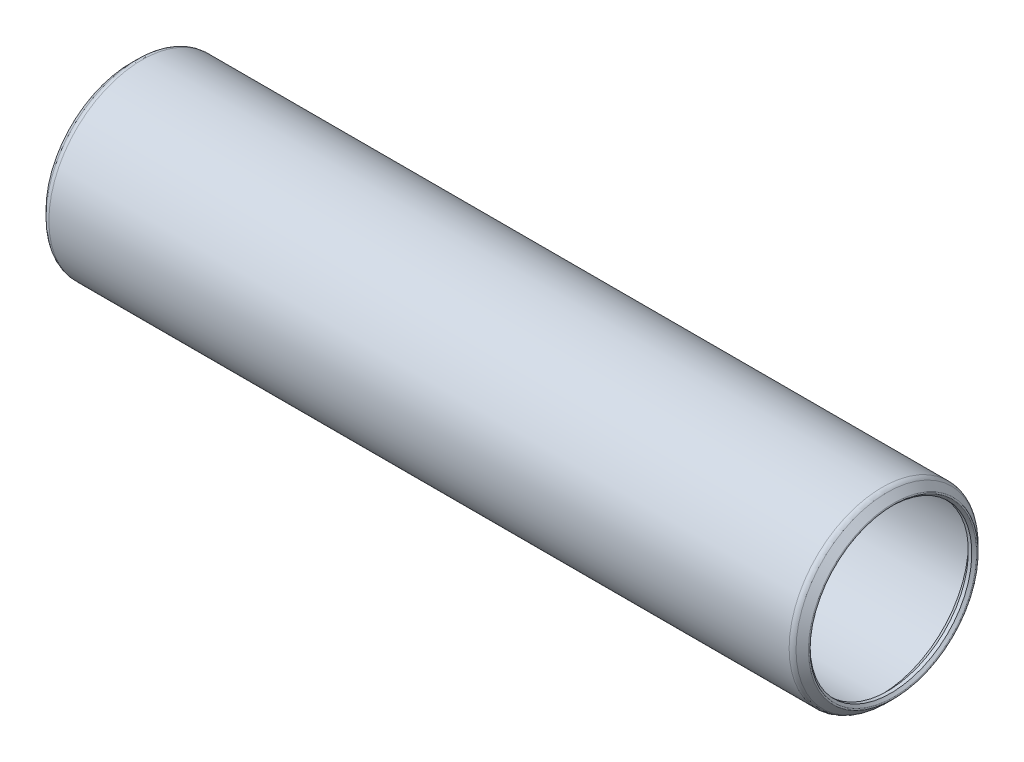
ISO-10303-21;
HEADER;
FILE_DESCRIPTION(('STEP AP214'),'2;1');
FILE_NAME('part.step','',(''),(''),'','','');
FILE_SCHEMA(('AUTOMOTIVE_DESIGN { 1 0 10303 214 1 1 1 1 }'));
ENDSEC;
DATA;
#1=APPLICATION_CONTEXT('core data for automotive mechanical design processes');
#2=APPLICATION_PROTOCOL_DEFINITION('international standard','automotive_design',2000,#1);
#3=PRODUCT_CONTEXT('',#1,'mechanical');
#4=PRODUCT('Part','Part','',(#3));
#5=PRODUCT_RELATED_PRODUCT_CATEGORY('part','',(#4));
#6=PRODUCT_DEFINITION_FORMATION('','',#4);
#7=PRODUCT_DEFINITION_CONTEXT('part definition',#1,'design');
#8=PRODUCT_DEFINITION('design','',#6,#7);
#9=PRODUCT_DEFINITION_SHAPE('','',#8);
#10=(LENGTH_UNIT() NAMED_UNIT(*) SI_UNIT(.MILLI.,.METRE.));
#11=(NAMED_UNIT(*) PLANE_ANGLE_UNIT() SI_UNIT($,.RADIAN.));
#12=(NAMED_UNIT(*) SI_UNIT($,.STERADIAN.) SOLID_ANGLE_UNIT());
#13=UNCERTAINTY_MEASURE_WITH_UNIT(LENGTH_MEASURE(1.E-05),#10,'distance_accuracy_value','');
#14=(GEOMETRIC_REPRESENTATION_CONTEXT(3) GLOBAL_UNCERTAINTY_ASSIGNED_CONTEXT((#13)) GLOBAL_UNIT_ASSIGNED_CONTEXT((#10,
#11,#12)) REPRESENTATION_CONTEXT('',''));
#15=CARTESIAN_POINT('',(0.,0.,0.));
#16=DIRECTION('',(0.,0.,1.));
#17=DIRECTION('',(1.,0.,0.));
#18=AXIS2_PLACEMENT_3D('',#15,#16,#17);
#19=CARTESIAN_POINT('',(-0.549710244842875,0.,0.));
#20=DIRECTION('',(-1.,0.,0.));
#21=DIRECTION('',(0.,0.,1.));
#22=AXIS2_PLACEMENT_3D('',#19,#20,#21);
#23=TOROIDAL_SURFACE('',#22,9.25736536726415,0.126999999999895);
#24=CARTESIAN_POINT('',(-0.639512806053455,0.,0.));
#25=DIRECTION('',(-1.,0.,0.));
#26=DIRECTION('',(0.,0.,1.));
#27=AXIS2_PLACEMENT_3D('',#24,#25,#26);
#28=CIRCLE('',#27,9.1675628060535);
#29=CARTESIAN_POINT('',(-0.639512806053455,0.,9.1675628060535));
#30=VERTEX_POINT('',#29);
#31=EDGE_CURVE('E10',#30,#30,#28,.T.);
#32=ORIENTED_EDGE('',*,*,#31,.F.);
#33=EDGE_LOOP('',(#32));
#34=FACE_BOUND('',#33,.T.);
#35=CARTESIAN_POINT('',(-0.639512806053455,0.,0.));
#36=DIRECTION('',(-1.,0.,0.));
#37=DIRECTION('',(0.,0.,1.));
#38=AXIS2_PLACEMENT_3D('',#35,#36,#37);
#39=CIRCLE('',#38,9.3471679284748);
#40=CARTESIAN_POINT('',(-0.639512806053455,0.,9.3471679284748));
#41=VERTEX_POINT('',#40);
#42=EDGE_CURVE('E78',#41,#41,#39,.T.);
#43=ORIENTED_EDGE('',*,*,#42,.T.);
#44=EDGE_LOOP('',(#43));
#45=FACE_BOUND('',#44,.T.);
#46=ADVANCED_FACE('F32',(#34,#45),#23,.T.);
#47=CARTESIAN_POINT('',(-0.639512806053455,0.,0.));
#48=DIRECTION('',(-1.,0.,0.));
#49=DIRECTION('',(0.,0.,1.));
#50=AXIS2_PLACEMENT_3D('',#47,#48,#49);
#51=CONICAL_SURFACE('',#50,9.1675628060535,0.785398163397549);
#52=CARTESIAN_POINT('',(-0.381000000000006,0.,0.));
#53=DIRECTION('',(-1.,0.,0.));
#54=DIRECTION('',(0.,0.,1.));
#55=AXIS2_PLACEMENT_3D('',#52,#53,#54);
#56=CIRCLE('',#55,8.90905);
#57=CARTESIAN_POINT('',(-0.381000000000006,0.,8.90905));
#58=VERTEX_POINT('',#57);
#59=EDGE_CURVE('E38',#58,#58,#56,.T.);
#60=ORIENTED_EDGE('',*,*,#59,.F.);
#61=EDGE_LOOP('',(#60));
#62=FACE_BOUND('',#61,.T.);
#63=ORIENTED_EDGE('',*,*,#31,.T.);
#64=EDGE_LOOP('',(#63));
#65=FACE_BOUND('',#64,.T.);
#66=ADVANCED_FACE('F151',(#62,#65),#51,.F.);
#67=CARTESIAN_POINT('',(82.7151,0.,0.));
#68=DIRECTION('',(-1.,0.,0.));
#69=DIRECTION('',(0.,0.,1.));
#70=AXIS2_PLACEMENT_3D('',#67,#68,#69);
#71=CYLINDRICAL_SURFACE('',#70,8.90905);
#72=CARTESIAN_POINT('',(0.,0.,0.));
#73=DIRECTION('',(-1.,0.,0.));
#74=DIRECTION('',(0.,0.,1.));
#75=AXIS2_PLACEMENT_3D('',#72,#73,#74);
#76=CIRCLE('',#75,8.90905);
#77=CARTESIAN_POINT('',(0.,0.,8.90905));
#78=VERTEX_POINT('',#77);
#79=EDGE_CURVE('E42',#78,#78,#76,.T.);
#80=ORIENTED_EDGE('',*,*,#79,.F.);
#81=EDGE_LOOP('',(#80));
#82=FACE_BOUND('',#81,.T.);
#83=ORIENTED_EDGE('',*,*,#59,.T.);
#84=EDGE_LOOP('',(#83));
#85=FACE_BOUND('',#84,.T.);
#86=ADVANCED_FACE('F146',(#82,#85),#71,.F.);
#87=CARTESIAN_POINT('',(0.,0.,0.));
#88=DIRECTION('',(1.,0.,0.));
#89=DIRECTION('',(0.,0.,-1.));
#90=AXIS2_PLACEMENT_3D('',#87,#88,#89);
#91=CONICAL_SURFACE('',#90,8.90905,0.785398163397448);
#92=CARTESIAN_POINT('',(0.761999999999999,0.,0.));
#93=DIRECTION('',(-1.,0.,0.));
#94=DIRECTION('',(0.,0.,1.));
#95=AXIS2_PLACEMENT_3D('',#92,#93,#94);
#96=CIRCLE('',#95,9.67105);
#97=CARTESIAN_POINT('',(0.761999999999999,0.,9.67105));
#98=VERTEX_POINT('',#97);
#99=EDGE_CURVE('E46',#98,#98,#96,.T.);
#100=ORIENTED_EDGE('',*,*,#99,.F.);
#101=EDGE_LOOP('',(#100));
#102=FACE_BOUND('',#101,.T.);
#103=ORIENTED_EDGE('',*,*,#79,.T.);
#104=EDGE_LOOP('',(#103));
#105=FACE_BOUND('',#104,.T.);
#106=ADVANCED_FACE('F140',(#102,#105),#91,.F.);
#107=CARTESIAN_POINT('',(82.7151,0.,0.));
#108=DIRECTION('',(-1.,0.,0.));
#109=DIRECTION('',(0.,0.,1.));
#110=AXIS2_PLACEMENT_3D('',#107,#108,#109);
#111=CYLINDRICAL_SURFACE('',#110,9.67105);
#112=CARTESIAN_POINT('',(81.9531,0.,0.));
#113=DIRECTION('',(-1.,0.,0.));
#114=DIRECTION('',(0.,0.,1.));
#115=AXIS2_PLACEMENT_3D('',#112,#113,#114);
#116=CIRCLE('',#115,9.67105);
#117=CARTESIAN_POINT('',(81.9531,0.,9.67105));
#118=VERTEX_POINT('',#117);
#119=EDGE_CURVE('E51',#118,#118,#116,.T.);
#120=ORIENTED_EDGE('',*,*,#119,.F.);
#121=EDGE_LOOP('',(#120));
#122=FACE_BOUND('',#121,.T.);
#123=ORIENTED_EDGE('',*,*,#99,.T.);
#124=EDGE_LOOP('',(#123));
#125=FACE_BOUND('',#124,.T.);
#126=ADVANCED_FACE('F134',(#122,#125),#111,.F.);
#127=CARTESIAN_POINT('',(81.9531,0.,0.));
#128=DIRECTION('',(-1.,0.,0.));
#129=DIRECTION('',(0.,0.,1.));
#130=AXIS2_PLACEMENT_3D('',#127,#128,#129);
#131=CONICAL_SURFACE('',#130,9.67105,0.785398163397448);
#132=CARTESIAN_POINT('',(82.7151,0.,0.));
#133=DIRECTION('',(-1.,0.,0.));
#134=DIRECTION('',(0.,0.,1.));
#135=AXIS2_PLACEMENT_3D('',#132,#133,#134);
#136=CIRCLE('',#135,8.90905);
#137=CARTESIAN_POINT('',(82.7151,0.,8.90905));
#138=VERTEX_POINT('',#137);
#139=EDGE_CURVE('E54',#138,#138,#136,.T.);
#140=ORIENTED_EDGE('',*,*,#139,.F.);
#141=EDGE_LOOP('',(#140));
#142=FACE_BOUND('',#141,.T.);
#143=ORIENTED_EDGE('',*,*,#119,.T.);
#144=EDGE_LOOP('',(#143));
#145=FACE_BOUND('',#144,.T.);
#146=ADVANCED_FACE('F128',(#142,#145),#131,.F.);
#147=CARTESIAN_POINT('',(82.7151,0.,0.));
#148=DIRECTION('',(-1.,0.,0.));
#149=DIRECTION('',(0.,0.,1.));
#150=AXIS2_PLACEMENT_3D('',#147,#148,#149);
#151=CYLINDRICAL_SURFACE('',#150,8.90905);
#152=CARTESIAN_POINT('',(83.0961,0.,0.));
#153=DIRECTION('',(-1.,0.,0.));
#154=DIRECTION('',(0.,0.,1.));
#155=AXIS2_PLACEMENT_3D('',#152,#153,#154);
#156=CIRCLE('',#155,8.90905);
#157=CARTESIAN_POINT('',(83.0961,0.,8.90905));
#158=VERTEX_POINT('',#157);
#159=EDGE_CURVE('E57',#158,#158,#156,.T.);
#160=ORIENTED_EDGE('',*,*,#159,.F.);
#161=EDGE_LOOP('',(#160));
#162=FACE_BOUND('',#161,.T.);
#163=ORIENTED_EDGE('',*,*,#139,.T.);
#164=EDGE_LOOP('',(#163));
#165=FACE_BOUND('',#164,.T.);
#166=ADVANCED_FACE('F122',(#162,#165),#151,.F.);
#167=CARTESIAN_POINT('',(83.0961,0.,0.));
#168=DIRECTION('',(1.,0.,0.));
#169=DIRECTION('',(0.,0.,-1.));
#170=AXIS2_PLACEMENT_3D('',#167,#168,#169);
#171=CONICAL_SURFACE('',#170,8.90905,0.785398163397666);
#172=CARTESIAN_POINT('',(83.3546128060545,0.,0.));
#173=DIRECTION('',(-1.,0.,0.));
#174=DIRECTION('',(0.,0.,1.));
#175=AXIS2_PLACEMENT_3D('',#172,#173,#174);
#176=CIRCLE('',#175,9.16756280605466);
#177=CARTESIAN_POINT('',(83.3546128060545,0.,9.16756280605466));
#178=VERTEX_POINT('',#177);
#179=EDGE_CURVE('E60',#178,#178,#176,.T.);
#180=ORIENTED_EDGE('',*,*,#179,.F.);
#181=EDGE_LOOP('',(#180));
#182=FACE_BOUND('',#181,.T.);
#183=ORIENTED_EDGE('',*,*,#159,.T.);
#184=EDGE_LOOP('',(#183));
#185=FACE_BOUND('',#184,.T.);
#186=ADVANCED_FACE('F116',(#182,#185),#171,.F.);
#187=CARTESIAN_POINT('',(83.2648102448448,0.,0.));
#188=DIRECTION('',(-1.,0.,0.));
#189=DIRECTION('',(0.,0.,1.));
#190=AXIS2_PLACEMENT_3D('',#187,#188,#189);
#191=TOROIDAL_SURFACE('',#190,9.25736536726415,0.126999999998503);
#192=CARTESIAN_POINT('',(83.3546128060546,0.,0.));
#193=DIRECTION('',(-1.,0.,0.));
#194=DIRECTION('',(0.,0.,1.));
#195=AXIS2_PLACEMENT_3D('',#192,#193,#194);
#196=CIRCLE('',#195,9.34716792847347);
#197=CARTESIAN_POINT('',(83.3546128060546,0.,9.34716792847347));
#198=VERTEX_POINT('',#197);
#199=EDGE_CURVE('E63',#198,#198,#196,.T.);
#200=ORIENTED_EDGE('',*,*,#199,.F.);
#201=EDGE_LOOP('',(#200));
#202=FACE_BOUND('',#201,.T.);
#203=ORIENTED_EDGE('',*,*,#179,.T.);
#204=EDGE_LOOP('',(#203));
#205=FACE_BOUND('',#204,.T.);
#206=ADVANCED_FACE('F110',(#202,#205),#191,.T.);
#207=CARTESIAN_POINT('',(83.3546128060546,0.,0.));
#208=DIRECTION('',(-1.,0.,0.));
#209=DIRECTION('',(0.,0.,1.));
#210=AXIS2_PLACEMENT_3D('',#207,#208,#209);
#211=CONICAL_SURFACE('',#210,9.34716792847347,0.785398163397457);
#212=CARTESIAN_POINT('',(82.6697153672624,0.,0.));
#213=DIRECTION('',(-1.,0.,0.));
#214=DIRECTION('',(0.,0.,1.));
#215=AXIS2_PLACEMENT_3D('',#212,#213,#214);
#216=CIRCLE('',#215,10.0320653672657);
#217=CARTESIAN_POINT('',(82.6697153672624,0.,10.0320653672657));
#218=VERTEX_POINT('',#217);
#219=EDGE_CURVE('E66',#218,#218,#216,.T.);
#220=ORIENTED_EDGE('',*,*,#219,.F.);
#221=EDGE_LOOP('',(#220));
#222=FACE_BOUND('',#221,.T.);
#223=ORIENTED_EDGE('',*,*,#199,.T.);
#224=EDGE_LOOP('',(#223));
#225=FACE_BOUND('',#224,.T.);
#226=ADVANCED_FACE('F104',(#222,#225),#211,.T.);
#227=CARTESIAN_POINT('',(82.1309000000018,0.,0.));
#228=DIRECTION('',(-1.,0.,0.));
#229=DIRECTION('',(0.,0.,1.));
#230=AXIS2_PLACEMENT_3D('',#227,#228,#229);
#231=TOROIDAL_SURFACE('',#230,9.49325000000495,0.76199999999511);
#232=CARTESIAN_POINT('',(82.1309000000018,0.,0.));
#233=DIRECTION('',(-1.,0.,0.));
#234=DIRECTION('',(0.,0.,1.));
#235=AXIS2_PLACEMENT_3D('',#232,#233,#234);
#236=CIRCLE('',#235,10.2552500000001);
#237=CARTESIAN_POINT('',(82.1309000000018,0.,10.2552500000001));
#238=VERTEX_POINT('',#237);
#239=EDGE_CURVE('E69',#238,#238,#236,.T.);
#240=ORIENTED_EDGE('',*,*,#239,.F.);
#241=EDGE_LOOP('',(#240));
#242=FACE_BOUND('',#241,.T.);
#243=ORIENTED_EDGE('',*,*,#219,.T.);
#244=EDGE_LOOP('',(#243));
#245=FACE_BOUND('',#244,.T.);
#246=ADVANCED_FACE('F98',(#242,#245),#231,.T.);
#247=CARTESIAN_POINT('',(82.7151,0.,0.));
#248=DIRECTION('',(-1.,0.,0.));
#249=DIRECTION('',(0.,0.,1.));
#250=AXIS2_PLACEMENT_3D('',#247,#248,#249);
#251=CYLINDRICAL_SURFACE('',#250,10.2552500000001);
#252=CARTESIAN_POINT('',(0.584199999997953,0.,0.));
#253=DIRECTION('',(-1.,0.,0.));
#254=DIRECTION('',(0.,0.,1.));
#255=AXIS2_PLACEMENT_3D('',#252,#253,#254);
#256=CIRCLE('',#255,10.2552500000001);
#257=CARTESIAN_POINT('',(0.584199999997953,0.,10.2552500000001));
#258=VERTEX_POINT('',#257);
#259=EDGE_CURVE('E72',#258,#258,#256,.T.);
#260=ORIENTED_EDGE('',*,*,#259,.F.);
#261=EDGE_LOOP('',(#260));
#262=FACE_BOUND('',#261,.T.);
#263=ORIENTED_EDGE('',*,*,#239,.T.);
#264=EDGE_LOOP('',(#263));
#265=FACE_BOUND('',#264,.T.);
#266=ADVANCED_FACE('F92',(#262,#265),#251,.T.);
#267=CARTESIAN_POINT('',(0.584199999998007,0.,0.));
#268=DIRECTION('',(-1.,0.,0.));
#269=DIRECTION('',(0.,0.,1.));
#270=AXIS2_PLACEMENT_3D('',#267,#268,#269);
#271=TOROIDAL_SURFACE('',#270,9.49325000000518,0.761999999994893);
#272=CARTESIAN_POINT('',(0.0453846327374552,0.,0.));
#273=DIRECTION('',(-1.,0.,0.));
#274=DIRECTION('',(0.,0.,1.));
#275=AXIS2_PLACEMENT_3D('',#272,#273,#274);
#276=CIRCLE('',#275,10.0320653672657);
#277=CARTESIAN_POINT('',(0.0453846327374552,0.,10.0320653672657));
#278=VERTEX_POINT('',#277);
#279=EDGE_CURVE('E75',#278,#278,#276,.T.);
#280=ORIENTED_EDGE('',*,*,#279,.F.);
#281=EDGE_LOOP('',(#280));
#282=FACE_BOUND('',#281,.T.);
#283=ORIENTED_EDGE('',*,*,#259,.T.);
#284=EDGE_LOOP('',(#283));
#285=FACE_BOUND('',#284,.T.);
#286=ADVANCED_FACE('F86',(#282,#285),#271,.T.);
#287=CARTESIAN_POINT('',(0.0453846327374552,0.,0.));
#288=DIRECTION('',(1.,0.,0.));
#289=DIRECTION('',(0.,0.,-1.));
#290=AXIS2_PLACEMENT_3D('',#287,#288,#289);
#291=CONICAL_SURFACE('',#290,10.0320653672657,0.785398163397456);
#292=ORIENTED_EDGE('',*,*,#42,.F.);
#293=EDGE_LOOP('',(#292));
#294=FACE_BOUND('',#293,.T.);
#295=ORIENTED_EDGE('',*,*,#279,.T.);
#296=EDGE_LOOP('',(#295));
#297=FACE_BOUND('',#296,.T.);
#298=ADVANCED_FACE('F83',(#294,#297),#291,.T.);
#299=CLOSED_SHELL('',(#46,#66,#86,#106,#126,#146,#166,#186,#206,#226,#246,#266,#286,#298));
#300=MANIFOLD_SOLID_BREP('B2',#299);
#301=ADVANCED_BREP_SHAPE_REPRESENTATION('',(#18,#300),#14);
#302=SHAPE_DEFINITION_REPRESENTATION(#9,#301);
ENDSEC;
END-ISO-10303-21;
